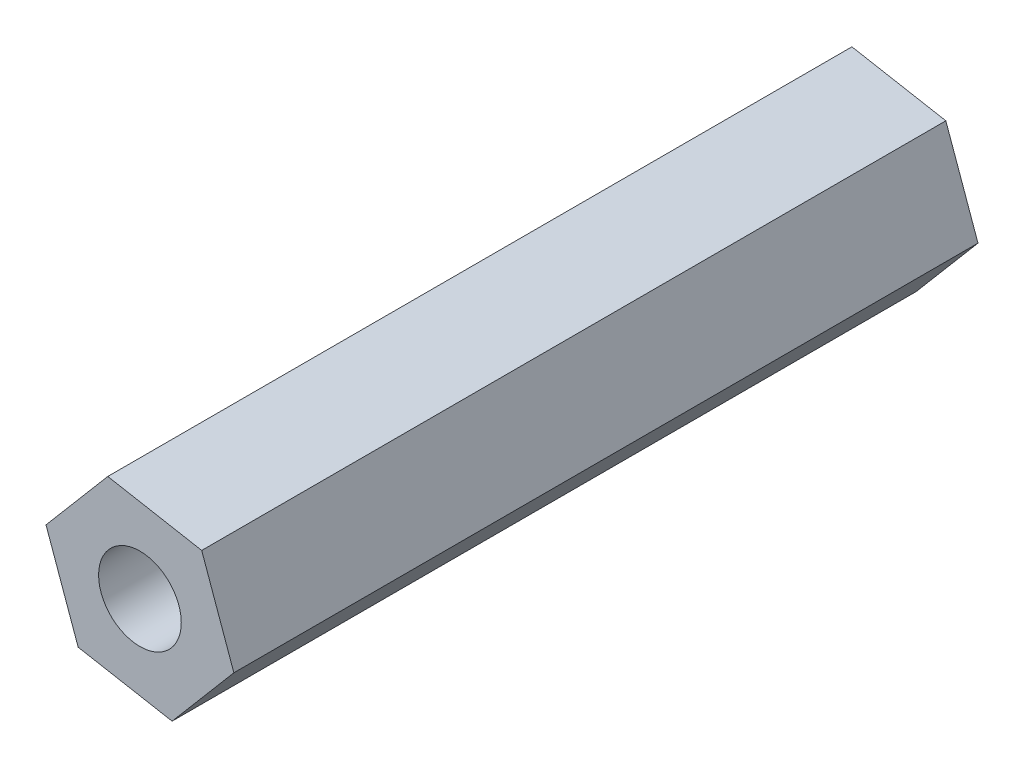
ISO-10303-21;
HEADER;
FILE_DESCRIPTION(('STEP AP214'),'2;1');
FILE_NAME('part.step','',(''),(''),'','','');
FILE_SCHEMA(('AUTOMOTIVE_DESIGN { 1 0 10303 214 1 1 1 1 }'));
ENDSEC;
DATA;
#1=APPLICATION_CONTEXT('core data for automotive mechanical design processes');
#2=APPLICATION_PROTOCOL_DEFINITION('international standard','automotive_design',2000,#1);
#3=PRODUCT_CONTEXT('',#1,'mechanical');
#4=PRODUCT('Part','Part','',(#3));
#5=PRODUCT_RELATED_PRODUCT_CATEGORY('part','',(#4));
#6=PRODUCT_DEFINITION_FORMATION('','',#4);
#7=PRODUCT_DEFINITION_CONTEXT('part definition',#1,'design');
#8=PRODUCT_DEFINITION('design','',#6,#7);
#9=PRODUCT_DEFINITION_SHAPE('','',#8);
#10=(LENGTH_UNIT() NAMED_UNIT(*) SI_UNIT(.MILLI.,.METRE.));
#11=(NAMED_UNIT(*) PLANE_ANGLE_UNIT() SI_UNIT($,.RADIAN.));
#12=(NAMED_UNIT(*) SI_UNIT($,.STERADIAN.) SOLID_ANGLE_UNIT());
#13=UNCERTAINTY_MEASURE_WITH_UNIT(LENGTH_MEASURE(1.E-05),#10,'distance_accuracy_value','');
#14=(GEOMETRIC_REPRESENTATION_CONTEXT(3) GLOBAL_UNCERTAINTY_ASSIGNED_CONTEXT((#13)) GLOBAL_UNIT_ASSIGNED_CONTEXT((#10,
#11,#12)) REPRESENTATION_CONTEXT('',''));
#15=CARTESIAN_POINT('',(0.,0.,0.));
#16=DIRECTION('',(0.,0.,1.));
#17=DIRECTION('',(1.,0.,0.));
#18=AXIS2_PLACEMENT_3D('',#15,#16,#17);
#19=CARTESIAN_POINT('',(14.100105118259,-7.40552271774973,27.));
#20=DIRECTION('',(-0.941553473498977,-0.336863557753005,0.));
#21=DIRECTION('',(0.336863557753005,-0.941553473498977,0.));
#22=AXIS2_PLACEMENT_3D('',#19,#20,#21);
#23=PLANE('',#22);
#24=DIRECTION('',(-0.336863557753005,0.941553473498977,0.));
#25=VECTOR('',#24,1.);
#26=CARTESIAN_POINT('',(14.100105118259,-7.40552271774973,0.));
#27=LINE('',#26,#25);
#28=CARTESIAN_POINT('',(14.100105118259,-7.40552271774973,0.));
#29=VERTEX_POINT('',#28);
#30=CARTESIAN_POINT('',(12.9331755237658,-4.14388580946336,0.));
#31=VERTEX_POINT('',#30);
#32=EDGE_CURVE('E116',#29,#31,#27,.T.);
#33=ORIENTED_EDGE('',*,*,#32,.T.);
#34=DIRECTION('',(0.,0.,-1.));
#35=VECTOR('',#34,1.);
#36=CARTESIAN_POINT('',(12.9331755237658,-4.14388580946336,27.));
#37=LINE('',#36,#35);
#38=CARTESIAN_POINT('',(12.9331755237658,-4.14388580946336,27.));
#39=VERTEX_POINT('',#38);
#40=EDGE_CURVE('E11',#39,#31,#37,.T.);
#41=ORIENTED_EDGE('',*,*,#40,.F.);
#42=DIRECTION('',(-0.336863557753005,0.941553473498977,0.));
#43=VECTOR('',#42,1.);
#44=CARTESIAN_POINT('',(14.100105118259,-7.40552271774973,27.));
#45=LINE('',#44,#43);
#46=CARTESIAN_POINT('',(14.100105118259,-7.40552271774973,27.));
#47=VERTEX_POINT('',#46);
#48=EDGE_CURVE('E127',#47,#39,#45,.T.);
#49=ORIENTED_EDGE('',*,*,#48,.F.);
#50=DIRECTION('',(0.,0.,-1.));
#51=VECTOR('',#50,1.);
#52=CARTESIAN_POINT('',(14.100105118259,-7.40552271774973,27.));
#53=LINE('',#52,#51);
#54=EDGE_CURVE('E112',#47,#29,#53,.T.);
#55=ORIENTED_EDGE('',*,*,#54,.T.);
#56=EDGE_LOOP('',(#33,#41,#49,#55));
#57=FACE_BOUND('',#56,.T.);
#58=ADVANCED_FACE('F32',(#57),#23,.F.);
#59=CARTESIAN_POINT('',(12.9331755237658,-4.14388580946336,27.));
#60=DIRECTION('',(-0.17904433812618,-0.983841005948094,0.));
#61=DIRECTION('',(0.983841005948094,-0.17904433812618,0.));
#62=AXIS2_PLACEMENT_3D('',#59,#60,#61);
#63=PLANE('',#62);
#64=DIRECTION('',(-0.983841005948094,0.17904433812618,0.));
#65=VECTOR('',#64,1.);
#66=CARTESIAN_POINT('',(12.9331755237658,-4.14388580946336,0.));
#67=LINE('',#66,#65);
#68=CARTESIAN_POINT('',(9.52505030602222,-3.52365802857919,0.));
#69=VERTEX_POINT('',#68);
#70=EDGE_CURVE('E119',#31,#69,#67,.T.);
#71=ORIENTED_EDGE('',*,*,#70,.T.);
#72=DIRECTION('',(0.,0.,-1.));
#73=VECTOR('',#72,1.);
#74=CARTESIAN_POINT('',(9.52505030602222,-3.52365802857919,27.));
#75=LINE('',#74,#73);
#76=CARTESIAN_POINT('',(9.52505030602222,-3.52365802857919,27.));
#77=VERTEX_POINT('',#76);
#78=EDGE_CURVE('E40',#77,#69,#75,.T.);
#79=ORIENTED_EDGE('',*,*,#78,.F.);
#80=DIRECTION('',(-0.983841005948094,0.17904433812618,0.));
#81=VECTOR('',#80,1.);
#82=CARTESIAN_POINT('',(12.9331755237658,-4.14388580946336,27.));
#83=LINE('',#82,#81);
#84=EDGE_CURVE('E85',#39,#77,#83,.T.);
#85=ORIENTED_EDGE('',*,*,#84,.F.);
#86=ORIENTED_EDGE('',*,*,#40,.T.);
#87=EDGE_LOOP('',(#71,#79,#85,#86));
#88=FACE_BOUND('',#87,.T.);
#89=ADVANCED_FACE('F152',(#88),#63,.F.);
#90=CARTESIAN_POINT('',(9.52505030602222,-3.52365802857919,27.));
#91=DIRECTION('',(0.762509135372797,-0.64697744819509,0.));
#92=DIRECTION('',(0.64697744819509,0.762509135372797,0.));
#93=AXIS2_PLACEMENT_3D('',#90,#91,#92);
#94=PLANE('',#93);
#95=DIRECTION('',(-0.64697744819509,-0.762509135372797,0.));
#96=VECTOR('',#95,1.);
#97=CARTESIAN_POINT('',(9.52505030602222,-3.52365802857919,0.));
#98=LINE('',#97,#96);
#99=CARTESIAN_POINT('',(7.28385468277191,-6.16506715598138,0.));
#100=VERTEX_POINT('',#99);
#101=EDGE_CURVE('E122',#69,#100,#98,.T.);
#102=ORIENTED_EDGE('',*,*,#101,.T.);
#103=DIRECTION('',(0.,0.,-1.));
#104=VECTOR('',#103,1.);
#105=CARTESIAN_POINT('',(7.28385468277191,-6.16506715598138,27.));
#106=LINE('',#105,#104);
#107=CARTESIAN_POINT('',(7.28385468277191,-6.16506715598138,27.));
#108=VERTEX_POINT('',#107);
#109=EDGE_CURVE('E107',#108,#100,#106,.T.);
#110=ORIENTED_EDGE('',*,*,#109,.F.);
#111=DIRECTION('',(-0.64697744819509,-0.762509135372797,0.));
#112=VECTOR('',#111,1.);
#113=CARTESIAN_POINT('',(9.52505030602222,-3.52365802857919,27.));
#114=LINE('',#113,#112);
#115=EDGE_CURVE('E98',#77,#108,#114,.T.);
#116=ORIENTED_EDGE('',*,*,#115,.F.);
#117=ORIENTED_EDGE('',*,*,#78,.T.);
#118=EDGE_LOOP('',(#102,#110,#116,#117));
#119=FACE_BOUND('',#118,.T.);
#120=ADVANCED_FACE('F133',(#119),#94,.F.);
#121=CARTESIAN_POINT('',(7.28385468277191,-6.16506715598138,27.));
#122=DIRECTION('',(0.941553473498977,0.336863557753005,0.));
#123=DIRECTION('',(-0.336863557753005,0.941553473498977,0.));
#124=AXIS2_PLACEMENT_3D('',#121,#122,#123);
#125=PLANE('',#124);
#126=DIRECTION('',(0.336863557753005,-0.941553473498977,0.));
#127=VECTOR('',#126,1.);
#128=CARTESIAN_POINT('',(7.28385468277191,-6.16506715598138,0.));
#129=LINE('',#128,#127);
#130=CARTESIAN_POINT('',(8.45078427726515,-9.42670406426776,0.));
#131=VERTEX_POINT('',#130);
#132=EDGE_CURVE('E106',#100,#131,#129,.T.);
#133=ORIENTED_EDGE('',*,*,#132,.T.);
#134=DIRECTION('',(0.,0.,-1.));
#135=VECTOR('',#134,1.);
#136=CARTESIAN_POINT('',(8.45078427726515,-9.42670406426776,27.));
#137=LINE('',#136,#135);
#138=CARTESIAN_POINT('',(8.45078427726515,-9.42670406426776,27.));
#139=VERTEX_POINT('',#138);
#140=EDGE_CURVE('E103',#139,#131,#137,.T.);
#141=ORIENTED_EDGE('',*,*,#140,.F.);
#142=DIRECTION('',(0.336863557753005,-0.941553473498977,0.));
#143=VECTOR('',#142,1.);
#144=CARTESIAN_POINT('',(7.28385468277191,-6.16506715598138,27.));
#145=LINE('',#144,#143);
#146=EDGE_CURVE('E92',#108,#139,#145,.T.);
#147=ORIENTED_EDGE('',*,*,#146,.F.);
#148=ORIENTED_EDGE('',*,*,#109,.T.);
#149=EDGE_LOOP('',(#133,#141,#147,#148));
#150=FACE_BOUND('',#149,.T.);
#151=ADVANCED_FACE('F104',(#150),#125,.F.);
#152=CARTESIAN_POINT('',(8.45078427726515,-9.42670406426776,27.));
#153=DIRECTION('',(0.17904433812618,0.983841005948094,0.));
#154=DIRECTION('',(-0.983841005948094,0.17904433812618,0.));
#155=AXIS2_PLACEMENT_3D('',#152,#153,#154);
#156=PLANE('',#155);
#157=DIRECTION('',(0.983841005948094,-0.17904433812618,0.));
#158=VECTOR('',#157,1.);
#159=CARTESIAN_POINT('',(8.45078427726515,-9.42670406426776,0.));
#160=LINE('',#159,#158);
#161=CARTESIAN_POINT('',(11.8589094950087,-10.0469318451519,0.));
#162=VERTEX_POINT('',#161);
#163=EDGE_CURVE('E71',#131,#162,#160,.T.);
#164=ORIENTED_EDGE('',*,*,#163,.T.);
#165=DIRECTION('',(0.,0.,-1.));
#166=VECTOR('',#165,1.);
#167=CARTESIAN_POINT('',(11.8589094950087,-10.0469318451519,27.));
#168=LINE('',#167,#166);
#169=CARTESIAN_POINT('',(11.8589094950087,-10.0469318451519,27.));
#170=VERTEX_POINT('',#169);
#171=EDGE_CURVE('E108',#170,#162,#168,.T.);
#172=ORIENTED_EDGE('',*,*,#171,.F.);
#173=DIRECTION('',(0.983841005948094,-0.17904433812618,0.));
#174=VECTOR('',#173,1.);
#175=CARTESIAN_POINT('',(8.45078427726515,-9.42670406426776,27.));
#176=LINE('',#175,#174);
#177=EDGE_CURVE('E96',#139,#170,#176,.T.);
#178=ORIENTED_EDGE('',*,*,#177,.F.);
#179=ORIENTED_EDGE('',*,*,#140,.T.);
#180=EDGE_LOOP('',(#164,#172,#178,#179));
#181=FACE_BOUND('',#180,.T.);
#182=ADVANCED_FACE('F110',(#181),#156,.F.);
#183=CARTESIAN_POINT('',(11.8589094950087,-10.0469318451519,27.));
#184=DIRECTION('',(-0.762509135372797,0.64697744819509,0.));
#185=DIRECTION('',(-0.64697744819509,-0.762509135372797,0.));
#186=AXIS2_PLACEMENT_3D('',#183,#184,#185);
#187=PLANE('',#186);
#188=DIRECTION('',(0.64697744819509,0.762509135372797,0.));
#189=VECTOR('',#188,1.);
#190=CARTESIAN_POINT('',(11.8589094950087,-10.0469318451519,0.));
#191=LINE('',#190,#189);
#192=EDGE_CURVE('E77',#162,#29,#191,.T.);
#193=ORIENTED_EDGE('',*,*,#192,.T.);
#194=ORIENTED_EDGE('',*,*,#54,.F.);
#195=DIRECTION('',(0.64697744819509,0.762509135372797,0.));
#196=VECTOR('',#195,1.);
#197=CARTESIAN_POINT('',(11.8589094950087,-10.0469318451519,27.));
#198=LINE('',#197,#196);
#199=EDGE_CURVE('E48',#170,#47,#198,.T.);
#200=ORIENTED_EDGE('',*,*,#199,.F.);
#201=ORIENTED_EDGE('',*,*,#171,.T.);
#202=EDGE_LOOP('',(#193,#194,#200,#201));
#203=FACE_BOUND('',#202,.T.);
#204=ADVANCED_FACE('F140',(#203),#187,.F.);
#205=CARTESIAN_POINT('',(0.,0.,27.));
#206=DIRECTION('',(0.,0.,1.));
#207=DIRECTION('',(1.,0.,0.));
#208=AXIS2_PLACEMENT_3D('',#205,#206,#207);
#209=PLANE('',#208);
#210=CARTESIAN_POINT('',(10.6919799005155,-6.78529493686556,27.));
#211=DIRECTION('',(0.,0.,1.));
#212=DIRECTION('',(1.,0.,0.));
#213=AXIS2_PLACEMENT_3D('',#210,#211,#212);
#214=CIRCLE('',#213,1.5);
#215=CARTESIAN_POINT('',(12.1919799005155,-6.78529493686556,27.));
#216=VERTEX_POINT('',#215);
#217=EDGE_CURVE('E120',#216,#216,#214,.T.);
#218=ORIENTED_EDGE('',*,*,#217,.F.);
#219=EDGE_LOOP('',(#218));
#220=FACE_BOUND('',#219,.T.);
#221=ORIENTED_EDGE('',*,*,#48,.T.);
#222=ORIENTED_EDGE('',*,*,#84,.T.);
#223=ORIENTED_EDGE('',*,*,#115,.T.);
#224=ORIENTED_EDGE('',*,*,#146,.T.);
#225=ORIENTED_EDGE('',*,*,#177,.T.);
#226=ORIENTED_EDGE('',*,*,#199,.T.);
#227=EDGE_LOOP('',(#221,#222,#223,#224,#225,#226));
#228=FACE_BOUND('',#227,.T.);
#229=ADVANCED_FACE('F94',(#220,#228),#209,.T.);
#230=CARTESIAN_POINT('',(0.,0.,0.));
#231=DIRECTION('',(0.,0.,1.));
#232=DIRECTION('',(1.,0.,0.));
#233=AXIS2_PLACEMENT_3D('',#230,#231,#232);
#234=PLANE('',#233);
#235=CARTESIAN_POINT('',(10.6919799005155,-6.78529493686556,0.));
#236=DIRECTION('',(0.,0.,-1.));
#237=DIRECTION('',(-1.,0.,0.));
#238=AXIS2_PLACEMENT_3D('',#235,#236,#237);
#239=CIRCLE('',#238,1.5);
#240=CARTESIAN_POINT('',(9.19197990051546,-6.78529493686556,0.));
#241=VERTEX_POINT('',#240);
#242=EDGE_CURVE('E207',#241,#241,#239,.T.);
#243=ORIENTED_EDGE('',*,*,#242,.F.);
#244=EDGE_LOOP('',(#243));
#245=FACE_BOUND('',#244,.T.);
#246=ORIENTED_EDGE('',*,*,#32,.F.);
#247=ORIENTED_EDGE('',*,*,#192,.F.);
#248=ORIENTED_EDGE('',*,*,#163,.F.);
#249=ORIENTED_EDGE('',*,*,#132,.F.);
#250=ORIENTED_EDGE('',*,*,#101,.F.);
#251=ORIENTED_EDGE('',*,*,#70,.F.);
#252=EDGE_LOOP('',(#246,#247,#248,#249,#250,#251));
#253=FACE_BOUND('',#252,.T.);
#254=ADVANCED_FACE('F136',(#245,#253),#234,.F.);
#255=CARTESIAN_POINT('',(10.6919799005155,-6.78529493686556,40.));
#256=DIRECTION('',(0.,0.,-1.));
#257=DIRECTION('',(-1.,0.,0.));
#258=AXIS2_PLACEMENT_3D('',#255,#256,#257);
#259=CYLINDRICAL_SURFACE('',#258,1.5);
#260=ORIENTED_EDGE('',*,*,#217,.T.);
#261=EDGE_LOOP('',(#260));
#262=FACE_BOUND('',#261,.T.);
#263=ORIENTED_EDGE('',*,*,#242,.T.);
#264=EDGE_LOOP('',(#263));
#265=FACE_BOUND('',#264,.T.);
#266=ADVANCED_FACE('F189',(#262,#265),#259,.F.);
#267=CLOSED_SHELL('',(#58,#89,#120,#151,#182,#204,#229,#254,#266));
#268=MANIFOLD_SOLID_BREP('B2',#267);
#269=ADVANCED_BREP_SHAPE_REPRESENTATION('',(#18,#268),#14);
#270=SHAPE_DEFINITION_REPRESENTATION(#9,#269);
ENDSEC;
END-ISO-10303-21;
